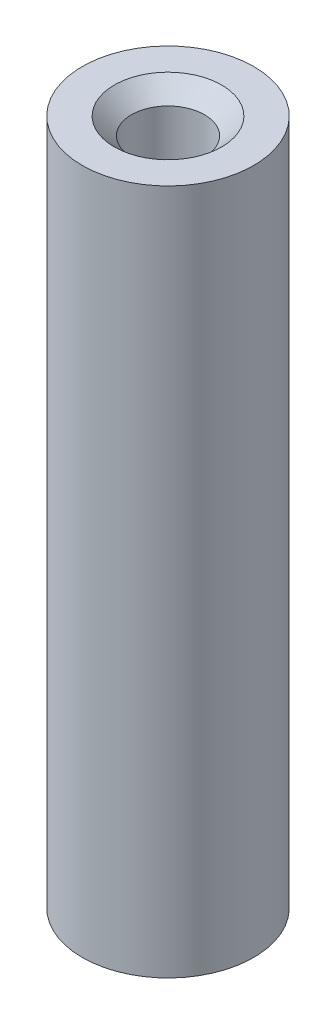
ISO-10303-21;
HEADER;
FILE_DESCRIPTION(('STEP AP214'),'2;1');
FILE_NAME('part.step','',(''),(''),'','','');
FILE_SCHEMA(('AUTOMOTIVE_DESIGN { 1 0 10303 214 1 1 1 1 }'));
ENDSEC;
DATA;
#1=APPLICATION_CONTEXT('core data for automotive mechanical design processes');
#2=APPLICATION_PROTOCOL_DEFINITION('international standard','automotive_design',2000,#1);
#3=PRODUCT_CONTEXT('',#1,'mechanical');
#4=PRODUCT('Part','Part','',(#3));
#5=PRODUCT_RELATED_PRODUCT_CATEGORY('part','',(#4));
#6=PRODUCT_DEFINITION_FORMATION('','',#4);
#7=PRODUCT_DEFINITION_CONTEXT('part definition',#1,'design');
#8=PRODUCT_DEFINITION('design','',#6,#7);
#9=PRODUCT_DEFINITION_SHAPE('','',#8);
#10=(LENGTH_UNIT() NAMED_UNIT(*) SI_UNIT(.MILLI.,.METRE.));
#11=(NAMED_UNIT(*) PLANE_ANGLE_UNIT() SI_UNIT($,.RADIAN.));
#12=(NAMED_UNIT(*) SI_UNIT($,.STERADIAN.) SOLID_ANGLE_UNIT());
#13=UNCERTAINTY_MEASURE_WITH_UNIT(LENGTH_MEASURE(1.E-05),#10,'distance_accuracy_value','');
#14=(GEOMETRIC_REPRESENTATION_CONTEXT(3) GLOBAL_UNCERTAINTY_ASSIGNED_CONTEXT((#13)) GLOBAL_UNIT_ASSIGNED_CONTEXT((#10,
#11,#12)) REPRESENTATION_CONTEXT('',''));
#15=CARTESIAN_POINT('',(0.,0.,0.));
#16=DIRECTION('',(0.,0.,1.));
#17=DIRECTION('',(1.,0.,0.));
#18=AXIS2_PLACEMENT_3D('',#15,#16,#17);
#19=CARTESIAN_POINT('',(0.,25.4,0.));
#20=DIRECTION('',(0.,-1.,0.));
#21=DIRECTION('',(0.,0.,-1.));
#22=AXIS2_PLACEMENT_3D('',#19,#20,#21);
#23=CYLINDRICAL_SURFACE('',#22,3.175);
#24=CARTESIAN_POINT('',(0.,25.4,0.));
#25=DIRECTION('',(0.,1.,0.));
#26=DIRECTION('',(0.,0.,1.));
#27=AXIS2_PLACEMENT_3D('',#24,#25,#26);
#28=CIRCLE('',#27,3.175);
#29=CARTESIAN_POINT('',(0.,25.4,3.175));
#30=VERTEX_POINT('',#29);
#31=EDGE_CURVE('E10',#30,#30,#28,.T.);
#32=ORIENTED_EDGE('',*,*,#31,.F.);
#33=EDGE_LOOP('',(#32));
#34=FACE_BOUND('',#33,.T.);
#35=CARTESIAN_POINT('',(0.,0.,0.));
#36=DIRECTION('',(0.,1.,0.));
#37=DIRECTION('',(0.,0.,1.));
#38=AXIS2_PLACEMENT_3D('',#35,#36,#37);
#39=CIRCLE('',#38,3.175);
#40=CARTESIAN_POINT('',(0.,0.,3.175));
#41=VERTEX_POINT('',#40);
#42=EDGE_CURVE('E33',#41,#41,#39,.T.);
#43=ORIENTED_EDGE('',*,*,#42,.T.);
#44=EDGE_LOOP('',(#43));
#45=FACE_BOUND('',#44,.T.);
#46=ADVANCED_FACE('F30',(#34,#45),#23,.T.);
#47=CARTESIAN_POINT('',(0.,25.4,0.));
#48=DIRECTION('',(0.,1.,0.));
#49=DIRECTION('',(0.,0.,1.));
#50=AXIS2_PLACEMENT_3D('',#47,#48,#49);
#51=PLANE('',#50);
#52=CARTESIAN_POINT('',(0.,25.4,0.));
#53=DIRECTION('',(0.,1.,0.));
#54=DIRECTION('',(0.,0.,1.));
#55=AXIS2_PLACEMENT_3D('',#52,#53,#54);
#56=CIRCLE('',#55,1.98755);
#57=CARTESIAN_POINT('',(0.,25.4,1.98755));
#58=VERTEX_POINT('',#57);
#59=EDGE_CURVE('E47',#58,#58,#56,.T.);
#60=ORIENTED_EDGE('',*,*,#59,.F.);
#61=EDGE_LOOP('',(#60));
#62=FACE_BOUND('',#61,.T.);
#63=ORIENTED_EDGE('',*,*,#31,.T.);
#64=EDGE_LOOP('',(#63));
#65=FACE_BOUND('',#64,.T.);
#66=ADVANCED_FACE('F75',(#62,#65),#51,.T.);
#67=CARTESIAN_POINT('',(0.,0.,0.));
#68=DIRECTION('',(0.,1.,0.));
#69=DIRECTION('',(0.,0.,1.));
#70=AXIS2_PLACEMENT_3D('',#67,#68,#69);
#71=PLANE('',#70);
#72=CARTESIAN_POINT('',(0.,0.,0.));
#73=DIRECTION('',(0.,1.,0.));
#74=DIRECTION('',(0.,0.,1.));
#75=AXIS2_PLACEMENT_3D('',#72,#73,#74);
#76=CIRCLE('',#75,1.98754999999999);
#77=CARTESIAN_POINT('',(0.,0.,1.98754999999999));
#78=VERTEX_POINT('',#77);
#79=EDGE_CURVE('E50',#78,#78,#76,.T.);
#80=ORIENTED_EDGE('',*,*,#79,.T.);
#81=EDGE_LOOP('',(#80));
#82=FACE_BOUND('',#81,.T.);
#83=ORIENTED_EDGE('',*,*,#42,.F.);
#84=EDGE_LOOP('',(#83));
#85=FACE_BOUND('',#84,.T.);
#86=ADVANCED_FACE('F54',(#82,#85),#71,.F.);
#87=CARTESIAN_POINT('',(0.,0.635000000000004,0.));
#88=DIRECTION('',(0.,-1.,0.));
#89=DIRECTION('',(0.,0.,-1.));
#90=AXIS2_PLACEMENT_3D('',#87,#88,#89);
#91=CONICAL_SURFACE('',#90,1.35254999999999,0.785398163397449);
#92=ORIENTED_EDGE('',*,*,#79,.F.);
#93=EDGE_LOOP('',(#92));
#94=FACE_BOUND('',#93,.T.);
#95=CARTESIAN_POINT('',(0.,0.635000000000004,0.));
#96=DIRECTION('',(0.,1.,0.));
#97=DIRECTION('',(0.,0.,1.));
#98=AXIS2_PLACEMENT_3D('',#95,#96,#97);
#99=CIRCLE('',#98,1.35254999999999);
#100=CARTESIAN_POINT('',(0.,0.635000000000004,1.35254999999999));
#101=VERTEX_POINT('',#100);
#102=EDGE_CURVE('E40',#101,#101,#99,.T.);
#103=ORIENTED_EDGE('',*,*,#102,.T.);
#104=EDGE_LOOP('',(#103));
#105=FACE_BOUND('',#104,.T.);
#106=ADVANCED_FACE('F57',(#94,#105),#91,.F.);
#107=CARTESIAN_POINT('',(0.,25.4,0.));
#108=DIRECTION('',(0.,1.,0.));
#109=DIRECTION('',(0.,0.,1.));
#110=AXIS2_PLACEMENT_3D('',#107,#108,#109);
#111=CYLINDRICAL_SURFACE('',#110,1.35255);
#112=ORIENTED_EDGE('',*,*,#102,.F.);
#113=EDGE_LOOP('',(#112));
#114=FACE_BOUND('',#113,.T.);
#115=CARTESIAN_POINT('',(0.,24.765,0.));
#116=DIRECTION('',(0.,1.,0.));
#117=DIRECTION('',(0.,0.,1.));
#118=AXIS2_PLACEMENT_3D('',#115,#116,#117);
#119=CIRCLE('',#118,1.35255);
#120=CARTESIAN_POINT('',(0.,24.765,1.35255));
#121=VERTEX_POINT('',#120);
#122=EDGE_CURVE('E44',#121,#121,#119,.T.);
#123=ORIENTED_EDGE('',*,*,#122,.T.);
#124=EDGE_LOOP('',(#123));
#125=FACE_BOUND('',#124,.T.);
#126=ADVANCED_FACE('F60',(#114,#125),#111,.F.);
#127=CARTESIAN_POINT('',(0.,25.4,0.));
#128=DIRECTION('',(0.,1.,0.));
#129=DIRECTION('',(0.,0.,1.));
#130=AXIS2_PLACEMENT_3D('',#127,#128,#129);
#131=CONICAL_SURFACE('',#130,1.98755,0.785398163397447);
#132=ORIENTED_EDGE('',*,*,#122,.F.);
#133=EDGE_LOOP('',(#132));
#134=FACE_BOUND('',#133,.T.);
#135=ORIENTED_EDGE('',*,*,#59,.T.);
#136=EDGE_LOOP('',(#135));
#137=FACE_BOUND('',#136,.T.);
#138=ADVANCED_FACE('F66',(#134,#137),#131,.F.);
#139=CLOSED_SHELL('',(#46,#66,#86,#106,#126,#138));
#140=MANIFOLD_SOLID_BREP('B2',#139);
#141=ADVANCED_BREP_SHAPE_REPRESENTATION('',(#18,#140),#14);
#142=SHAPE_DEFINITION_REPRESENTATION(#9,#141);
ENDSEC;
END-ISO-10303-21;
